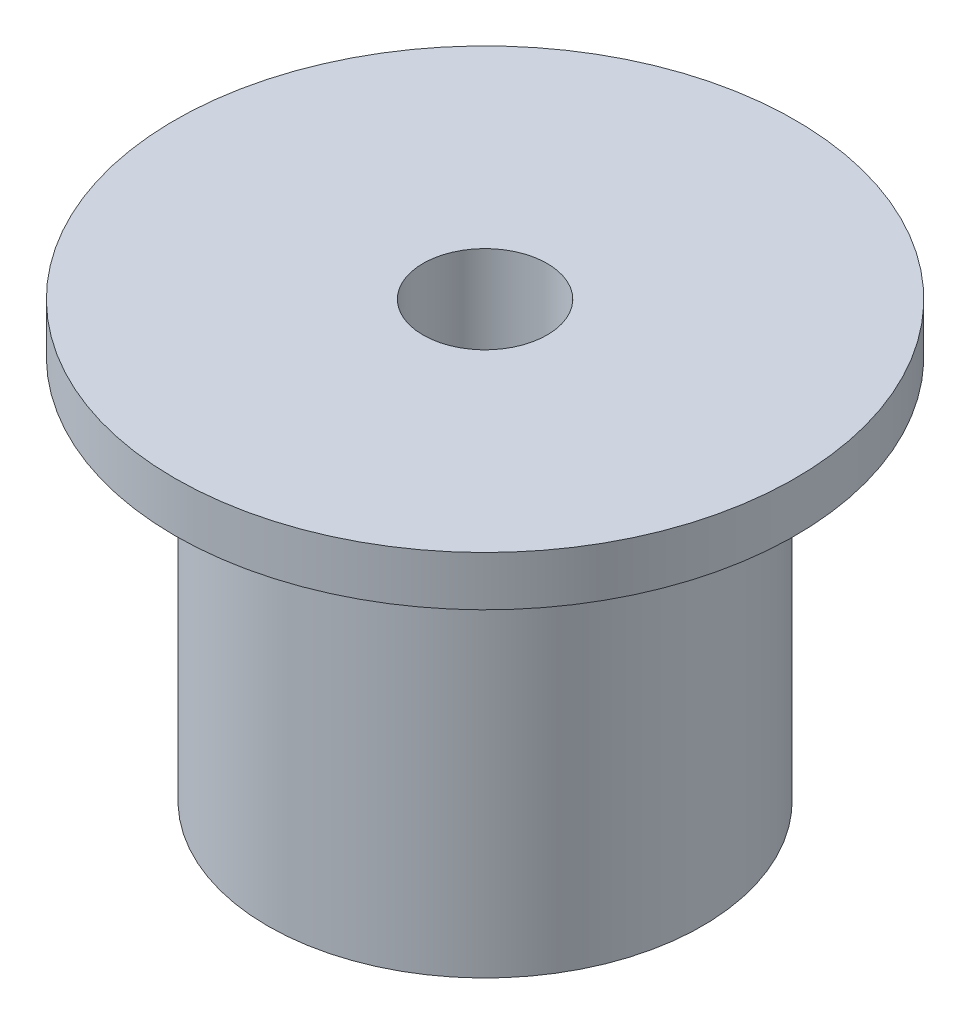
ISO-10303-21;
HEADER;
FILE_DESCRIPTION(('STEP AP214'),'2;1');
FILE_NAME('part.step','',(''),(''),'','','');
FILE_SCHEMA(('AUTOMOTIVE_DESIGN { 1 0 10303 214 1 1 1 1 }'));
ENDSEC;
DATA;
#1=APPLICATION_CONTEXT('core data for automotive mechanical design processes');
#2=APPLICATION_PROTOCOL_DEFINITION('international standard','automotive_design',2000,#1);
#3=PRODUCT_CONTEXT('',#1,'mechanical');
#4=PRODUCT('Part','Part','',(#3));
#5=PRODUCT_RELATED_PRODUCT_CATEGORY('part','',(#4));
#6=PRODUCT_DEFINITION_FORMATION('','',#4);
#7=PRODUCT_DEFINITION_CONTEXT('part definition',#1,'design');
#8=PRODUCT_DEFINITION('design','',#6,#7);
#9=PRODUCT_DEFINITION_SHAPE('','',#8);
#10=(LENGTH_UNIT() NAMED_UNIT(*) SI_UNIT(.MILLI.,.METRE.));
#11=(NAMED_UNIT(*) PLANE_ANGLE_UNIT() SI_UNIT($,.RADIAN.));
#12=(NAMED_UNIT(*) SI_UNIT($,.STERADIAN.) SOLID_ANGLE_UNIT());
#13=UNCERTAINTY_MEASURE_WITH_UNIT(LENGTH_MEASURE(1.E-05),#10,'distance_accuracy_value','');
#14=(GEOMETRIC_REPRESENTATION_CONTEXT(3) GLOBAL_UNCERTAINTY_ASSIGNED_CONTEXT((#13)) GLOBAL_UNIT_ASSIGNED_CONTEXT((#10,
#11,#12)) REPRESENTATION_CONTEXT('',''));
#15=CARTESIAN_POINT('',(0.,0.,0.));
#16=DIRECTION('',(0.,0.,1.));
#17=DIRECTION('',(1.,0.,0.));
#18=AXIS2_PLACEMENT_3D('',#15,#16,#17);
#19=CARTESIAN_POINT('',(0.,22.225,0.));
#20=DIRECTION('',(0.,-1.,0.));
#21=DIRECTION('',(0.,0.,-1.));
#22=AXIS2_PLACEMENT_3D('',#19,#20,#21);
#23=CYLINDRICAL_SURFACE('',#22,11.1125);
#24=CARTESIAN_POINT('',(0.,0.,0.));
#25=DIRECTION('',(0.,1.,0.));
#26=DIRECTION('',(0.,0.,1.));
#27=AXIS2_PLACEMENT_3D('',#24,#25,#26);
#28=CIRCLE('',#27,11.1125);
#29=CARTESIAN_POINT('',(0.,0.,11.1125));
#30=VERTEX_POINT('',#29);
#31=EDGE_CURVE('E36',#30,#30,#28,.T.);
#32=ORIENTED_EDGE('',*,*,#31,.T.);
#33=EDGE_LOOP('',(#32));
#34=FACE_BOUND('',#33,.T.);
#35=CARTESIAN_POINT('',(0.,19.685,0.));
#36=DIRECTION('',(0.,1.,0.));
#37=DIRECTION('',(0.,0.,1.));
#38=AXIS2_PLACEMENT_3D('',#35,#36,#37);
#39=CIRCLE('',#38,11.1125);
#40=CARTESIAN_POINT('',(0.,19.685,11.1125));
#41=VERTEX_POINT('',#40);
#42=EDGE_CURVE('E10',#41,#41,#39,.T.);
#43=ORIENTED_EDGE('',*,*,#42,.F.);
#44=EDGE_LOOP('',(#43));
#45=FACE_BOUND('',#44,.T.);
#46=ADVANCED_FACE('F30',(#34,#45),#23,.T.);
#47=CARTESIAN_POINT('',(0.,0.,0.));
#48=DIRECTION('',(0.,1.,0.));
#49=DIRECTION('',(0.,0.,1.));
#50=AXIS2_PLACEMENT_3D('',#47,#48,#49);
#51=PLANE('',#50);
#52=CARTESIAN_POINT('',(0.,0.,0.));
#53=DIRECTION('',(0.,1.,0.));
#54=DIRECTION('',(0.,0.,1.));
#55=AXIS2_PLACEMENT_3D('',#52,#53,#54);
#56=CIRCLE('',#55,3.17499999999999);
#57=CARTESIAN_POINT('',(0.,0.,3.17499999999999));
#58=VERTEX_POINT('',#57);
#59=EDGE_CURVE('E48',#58,#58,#56,.T.);
#60=ORIENTED_EDGE('',*,*,#59,.T.);
#61=EDGE_LOOP('',(#60));
#62=FACE_BOUND('',#61,.T.);
#63=ORIENTED_EDGE('',*,*,#31,.F.);
#64=EDGE_LOOP('',(#63));
#65=FACE_BOUND('',#64,.T.);
#66=ADVANCED_FACE('F67',(#62,#65),#51,.F.);
#67=CARTESIAN_POINT('',(0.,19.685,0.));
#68=DIRECTION('',(0.,1.,0.));
#69=DIRECTION('',(0.,0.,1.));
#70=AXIS2_PLACEMENT_3D('',#67,#68,#69);
#71=CYLINDRICAL_SURFACE('',#70,15.875);
#72=CARTESIAN_POINT('',(0.,19.685,0.));
#73=DIRECTION('',(0.,1.,0.));
#74=DIRECTION('',(0.,0.,1.));
#75=AXIS2_PLACEMENT_3D('',#72,#73,#74);
#76=CIRCLE('',#75,15.875);
#77=CARTESIAN_POINT('',(0.,19.685,15.875));
#78=VERTEX_POINT('',#77);
#79=EDGE_CURVE('E40',#78,#78,#76,.T.);
#80=ORIENTED_EDGE('',*,*,#79,.T.);
#81=EDGE_LOOP('',(#80));
#82=FACE_BOUND('',#81,.T.);
#83=CARTESIAN_POINT('',(0.,22.225,0.));
#84=DIRECTION('',(0.,1.,0.));
#85=DIRECTION('',(0.,0.,1.));
#86=AXIS2_PLACEMENT_3D('',#83,#84,#85);
#87=CIRCLE('',#86,15.875);
#88=CARTESIAN_POINT('',(0.,22.225,15.875));
#89=VERTEX_POINT('',#88);
#90=EDGE_CURVE('E44',#89,#89,#87,.T.);
#91=ORIENTED_EDGE('',*,*,#90,.F.);
#92=EDGE_LOOP('',(#91));
#93=FACE_BOUND('',#92,.T.);
#94=ADVANCED_FACE('F65',(#82,#93),#71,.T.);
#95=CARTESIAN_POINT('',(0.,19.685,0.));
#96=DIRECTION('',(0.,1.,0.));
#97=DIRECTION('',(0.,0.,1.));
#98=AXIS2_PLACEMENT_3D('',#95,#96,#97);
#99=PLANE('',#98);
#100=ORIENTED_EDGE('',*,*,#42,.T.);
#101=EDGE_LOOP('',(#100));
#102=FACE_BOUND('',#101,.T.);
#103=ORIENTED_EDGE('',*,*,#79,.F.);
#104=EDGE_LOOP('',(#103));
#105=FACE_BOUND('',#104,.T.);
#106=ADVANCED_FACE('F61',(#102,#105),#99,.F.);
#107=CARTESIAN_POINT('',(0.,22.225,0.));
#108=DIRECTION('',(0.,1.,0.));
#109=DIRECTION('',(0.,0.,1.));
#110=AXIS2_PLACEMENT_3D('',#107,#108,#109);
#111=PLANE('',#110);
#112=CARTESIAN_POINT('',(0.,22.225,0.));
#113=DIRECTION('',(0.,1.,0.));
#114=DIRECTION('',(0.,0.,1.));
#115=AXIS2_PLACEMENT_3D('',#112,#113,#114);
#116=CIRCLE('',#115,3.17499999999999);
#117=CARTESIAN_POINT('',(0.,22.225,3.17499999999999));
#118=VERTEX_POINT('',#117);
#119=EDGE_CURVE('E52',#118,#118,#116,.T.);
#120=ORIENTED_EDGE('',*,*,#119,.F.);
#121=EDGE_LOOP('',(#120));
#122=FACE_BOUND('',#121,.T.);
#123=ORIENTED_EDGE('',*,*,#90,.T.);
#124=EDGE_LOOP('',(#123));
#125=FACE_BOUND('',#124,.T.);
#126=ADVANCED_FACE('F58',(#122,#125),#111,.T.);
#127=CARTESIAN_POINT('',(0.,22.225,0.));
#128=DIRECTION('',(0.,1.,0.));
#129=DIRECTION('',(0.,0.,1.));
#130=AXIS2_PLACEMENT_3D('',#127,#128,#129);
#131=CYLINDRICAL_SURFACE('',#130,3.17499999999999);
#132=ORIENTED_EDGE('',*,*,#59,.F.);
#133=EDGE_LOOP('',(#132));
#134=FACE_BOUND('',#133,.T.);
#135=ORIENTED_EDGE('',*,*,#119,.T.);
#136=EDGE_LOOP('',(#135));
#137=FACE_BOUND('',#136,.T.);
#138=ADVANCED_FACE('F56',(#134,#137),#131,.F.);
#139=CLOSED_SHELL('',(#46,#66,#94,#106,#126,#138));
#140=MANIFOLD_SOLID_BREP('B2',#139);
#141=ADVANCED_BREP_SHAPE_REPRESENTATION('',(#18,#140),#14);
#142=SHAPE_DEFINITION_REPRESENTATION(#9,#141);
ENDSEC;
END-ISO-10303-21;
